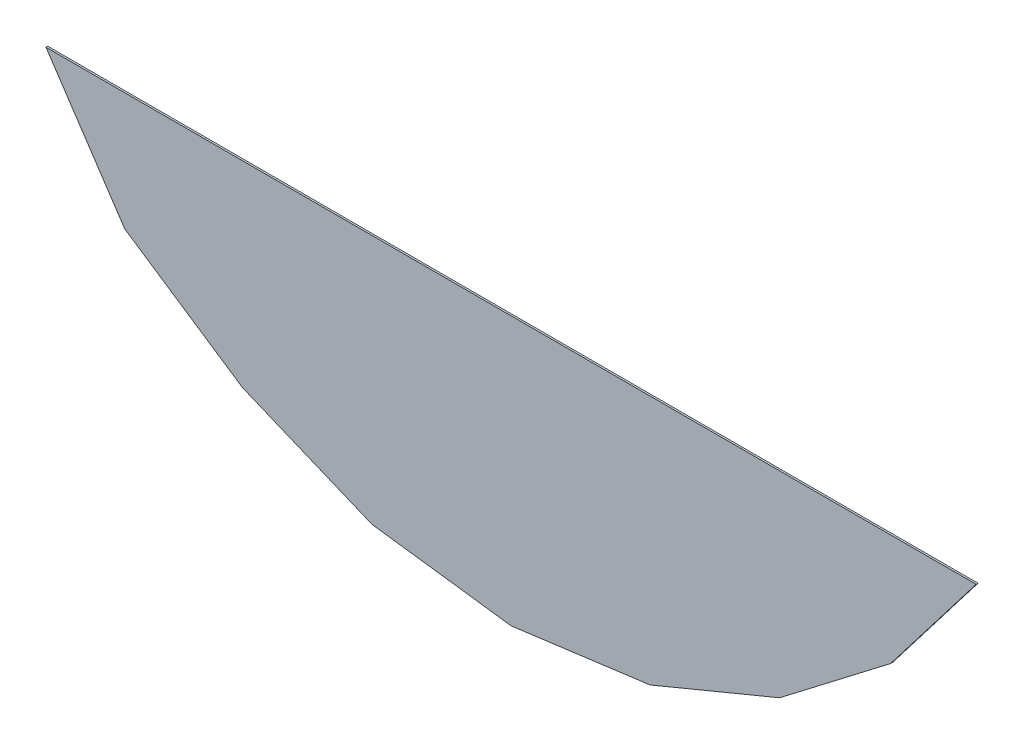
ISO-10303-21;
HEADER;
FILE_DESCRIPTION(('STEP AP214'),'2;1');
FILE_NAME('part.step','',(''),(''),'','','');
FILE_SCHEMA(('AUTOMOTIVE_DESIGN { 1 0 10303 214 1 1 1 1 }'));
ENDSEC;
DATA;
#1=APPLICATION_CONTEXT('core data for automotive mechanical design processes');
#2=APPLICATION_PROTOCOL_DEFINITION('international standard','automotive_design',2000,#1);
#3=PRODUCT_CONTEXT('',#1,'mechanical');
#4=PRODUCT('Part','Part','',(#3));
#5=PRODUCT_RELATED_PRODUCT_CATEGORY('part','',(#4));
#6=PRODUCT_DEFINITION_FORMATION('','',#4);
#7=PRODUCT_DEFINITION_CONTEXT('part definition',#1,'design');
#8=PRODUCT_DEFINITION('design','',#6,#7);
#9=PRODUCT_DEFINITION_SHAPE('','',#8);
#10=(LENGTH_UNIT() NAMED_UNIT(*) SI_UNIT(.MILLI.,.METRE.));
#11=(NAMED_UNIT(*) PLANE_ANGLE_UNIT() SI_UNIT($,.RADIAN.));
#12=(NAMED_UNIT(*) SI_UNIT($,.STERADIAN.) SOLID_ANGLE_UNIT());
#13=UNCERTAINTY_MEASURE_WITH_UNIT(LENGTH_MEASURE(1.E-05),#10,'distance_accuracy_value','');
#14=(GEOMETRIC_REPRESENTATION_CONTEXT(3) GLOBAL_UNCERTAINTY_ASSIGNED_CONTEXT((#13)) GLOBAL_UNIT_ASSIGNED_CONTEXT((#10,
#11,#12)) REPRESENTATION_CONTEXT('',''));
#15=CARTESIAN_POINT('',(0.,0.,0.));
#16=DIRECTION('',(0.,0.,1.));
#17=DIRECTION('',(1.,0.,0.));
#18=AXIS2_PLACEMENT_3D('',#15,#16,#17);
#19=CARTESIAN_POINT('',(-2.55477772,-4.28920148,3.9099998));
#20=DIRECTION('',(0.,0.,1.));
#21=DIRECTION('',(1.,0.,0.));
#22=AXIS2_PLACEMENT_3D('',#19,#20,#21);
#23=PLANE('',#22);
#24=DIRECTION('',(0.923879753352675,0.382682899206379,0.));
#25=VECTOR('',#24,1.);
#26=CARTESIAN_POINT('',(0.76351384,-5.66368184,3.9099998));
#27=LINE('',#26,#25);
#28=CARTESIAN_POINT('',(0.763513839999965,-5.66368183999992,3.9099998));
#29=VERTEX_POINT('',#28);
#30=CARTESIAN_POINT('',(1.47499832000001,-5.36897580000001,3.9099998));
#31=VERTEX_POINT('',#30);
#32=EDGE_CURVE('E91',#29,#31,#27,.T.);
#33=ORIENTED_EDGE('',*,*,#32,.T.);
#34=DIRECTION('',(0.79335418726781,0.608760325205768,0.));
#35=VECTOR('',#34,1.);
#36=CARTESIAN_POINT('',(1.47499832,-5.3689758,3.9099998));
#37=LINE('',#36,#35);
#38=CARTESIAN_POINT('',(2.08596230000002,-4.90016800000001,3.9099998));
#39=VERTEX_POINT('',#38);
#40=EDGE_CURVE('E88',#31,#39,#37,.T.);
#41=ORIENTED_EDGE('',*,*,#40,.T.);
#42=DIRECTION('',(0.608760808228414,0.793353816632332,0.));
#43=VECTOR('',#42,1.);
#44=CARTESIAN_POINT('',(2.0859623,-4.900168,3.9099998));
#45=LINE('',#44,#43);
#46=CARTESIAN_POINT('',(2.55477264,-4.28920148,3.9099998));
#47=VERTEX_POINT('',#46);
#48=EDGE_CURVE('E20',#39,#47,#45,.T.);
#49=ORIENTED_EDGE('',*,*,#48,.T.);
#50=DIRECTION('',(1.,0.,0.));
#51=VECTOR('',#50,1.);
#52=CARTESIAN_POINT('',(-2.55477772,-4.28920148,3.9099998));
#53=LINE('',#52,#51);
#54=CARTESIAN_POINT('',(-2.55477772000004,-4.28920148000002,3.9099998));
#55=VERTEX_POINT('',#54);
#56=EDGE_CURVE('E94',#55,#47,#53,.T.);
#57=ORIENTED_EDGE('',*,*,#56,.F.);
#58=DIRECTION('',(0.555139797690014,-0.831757058894417,0.));
#59=VECTOR('',#58,1.);
#60=CARTESIAN_POINT('',(-2.55477772,-4.28920148,3.9099998));
#61=LINE('',#60,#59);
#62=CARTESIAN_POINT('',(-2.12257131999998,-4.93676939999997,3.9099998));
#63=VERTEX_POINT('',#62);
#64=EDGE_CURVE('E84',#55,#63,#61,.T.);
#65=ORIENTED_EDGE('',*,*,#64,.T.);
#66=DIRECTION('',(0.831757058894417,-0.555139797690014,0.));
#67=VECTOR('',#66,1.);
#68=CARTESIAN_POINT('',(-2.12257132,-4.9367694,3.9099998));
#69=LINE('',#68,#67);
#70=CARTESIAN_POINT('',(-1.47500340000004,-5.36897580000008,3.9099998));
#71=VERTEX_POINT('',#70);
#72=EDGE_CURVE('E105',#63,#71,#69,.T.);
#73=ORIENTED_EDGE('',*,*,#72,.T.);
#74=DIRECTION('',(0.923879753352675,-0.382682899206379,0.));
#75=VECTOR('',#74,1.);
#76=CARTESIAN_POINT('',(-1.4750034,-5.3689758,3.9099998));
#77=LINE('',#76,#75);
#78=CARTESIAN_POINT('',(-0.763518920000013,-5.66368184000008,3.9099998));
#79=VERTEX_POINT('',#78);
#80=EDGE_CURVE('E106',#71,#79,#77,.T.);
#81=ORIENTED_EDGE('',*,*,#80,.T.);
#82=DIRECTION('',(0.991445008976764,-0.130525071059416,0.));
#83=VECTOR('',#82,1.);
#84=CARTESIAN_POINT('',(-0.76351892,-5.66368184,3.9099998));
#85=LINE('',#84,#83);
#86=CARTESIAN_POINT('',(-2.5400000201614E-06,-5.76419979999992,3.9099998));
#87=VERTEX_POINT('',#86);
#88=EDGE_CURVE('E110',#79,#87,#85,.T.);
#89=ORIENTED_EDGE('',*,*,#88,.T.);
#90=DIRECTION('',(0.991445008976764,0.130525071059413,0.));
#91=VECTOR('',#90,1.);
#92=CARTESIAN_POINT('',(-2.54000000806526E-06,-5.7641998,3.9099998));
#93=LINE('',#92,#91);
#94=EDGE_CURVE('E112',#87,#29,#93,.T.);
#95=ORIENTED_EDGE('',*,*,#94,.T.);
#96=EDGE_LOOP('',(#33,#41,#49,#57,#65,#73,#81,#89,#95));
#97=FACE_BOUND('',#96,.T.);
#98=ADVANCED_FACE('F17',(#97),#23,.T.);
#99=CARTESIAN_POINT('',(-2.55477772,-4.28920148,3.89999982));
#100=DIRECTION('',(0.,1.,0.));
#101=DIRECTION('',(0.,0.,1.));
#102=AXIS2_PLACEMENT_3D('',#99,#100,#101);
#103=PLANE('',#102);
#104=DIRECTION('',(0.,0.,1.));
#105=VECTOR('',#104,1.);
#106=CARTESIAN_POINT('',(-2.55477772000014,-4.2892014800001,3.89999982));
#107=LINE('',#106,#105);
#108=CARTESIAN_POINT('',(-2.55477772000004,-4.28920148000002,3.89999982));
#109=VERTEX_POINT('',#108);
#110=EDGE_CURVE('E116',#55,#109,#107,.F.);
#111=ORIENTED_EDGE('',*,*,#110,.F.);
#112=ORIENTED_EDGE('',*,*,#56,.T.);
#113=DIRECTION('',(0.,0.,1.));
#114=VECTOR('',#113,1.);
#115=CARTESIAN_POINT('',(2.55477264,-4.28920148,3.89999982));
#116=LINE('',#115,#114);
#117=CARTESIAN_POINT('',(2.55477264,-4.28920148,3.89999982));
#118=VERTEX_POINT('',#117);
#119=EDGE_CURVE('E99',#118,#47,#116,.T.);
#120=ORIENTED_EDGE('',*,*,#119,.F.);
#121=DIRECTION('',(1.,0.,0.));
#122=VECTOR('',#121,1.);
#123=CARTESIAN_POINT('',(-2.55477772,-4.28920148,3.89999982));
#124=LINE('',#123,#122);
#125=EDGE_CURVE('E130',#118,#109,#124,.F.);
#126=ORIENTED_EDGE('',*,*,#125,.T.);
#127=EDGE_LOOP('',(#111,#112,#120,#126));
#128=FACE_BOUND('',#127,.T.);
#129=ADVANCED_FACE('F181',(#128),#103,.T.);
#130=CARTESIAN_POINT('',(-2.12257132,-4.9367694,3.89999982));
#131=DIRECTION('',(-0.831757058894295,-0.555139797690197,0.));
#132=DIRECTION('',(0.555139797690197,-0.831757058894295,0.));
#133=AXIS2_PLACEMENT_3D('',#130,#131,#132);
#134=PLANE('',#133);
#135=DIRECTION('',(0.,0.,1.));
#136=VECTOR('',#135,1.);
#137=CARTESIAN_POINT('',(-2.12257131999991,-4.93676939999986,3.89999982));
#138=LINE('',#137,#136);
#139=CARTESIAN_POINT('',(-2.12257131999998,-4.93676939999997,3.89999982));
#140=VERTEX_POINT('',#139);
#141=EDGE_CURVE('E118',#63,#140,#138,.F.);
#142=ORIENTED_EDGE('',*,*,#141,.F.);
#143=ORIENTED_EDGE('',*,*,#64,.F.);
#144=ORIENTED_EDGE('',*,*,#110,.T.);
#145=DIRECTION('',(0.555139797690014,-0.831757058894417,0.));
#146=VECTOR('',#145,1.);
#147=CARTESIAN_POINT('',(-2.55477772,-4.28920148,3.89999982));
#148=LINE('',#147,#146);
#149=EDGE_CURVE('E133',#109,#140,#148,.T.);
#150=ORIENTED_EDGE('',*,*,#149,.T.);
#151=EDGE_LOOP('',(#142,#143,#144,#150));
#152=FACE_BOUND('',#151,.T.);
#153=ADVANCED_FACE('F178',(#152),#134,.T.);
#154=CARTESIAN_POINT('',(-1.4750034,-5.3689758,3.89999982));
#155=DIRECTION('',(-0.555139797690197,-0.831757058894295,0.));
#156=DIRECTION('',(0.831757058894295,-0.555139797690197,0.));
#157=AXIS2_PLACEMENT_3D('',#154,#155,#156);
#158=PLANE('',#157);
#159=DIRECTION('',(0.,0.,1.));
#160=VECTOR('',#159,1.);
#161=CARTESIAN_POINT('',(-1.47500340000014,-5.36897580000034,3.89999982));
#162=LINE('',#161,#160);
#163=CARTESIAN_POINT('',(-1.47500340000004,-5.36897580000008,3.89999982));
#164=VERTEX_POINT('',#163);
#165=EDGE_CURVE('E120',#71,#164,#162,.F.);
#166=ORIENTED_EDGE('',*,*,#165,.F.);
#167=ORIENTED_EDGE('',*,*,#72,.F.);
#168=ORIENTED_EDGE('',*,*,#141,.T.);
#169=DIRECTION('',(0.831757058894417,-0.555139797690014,0.));
#170=VECTOR('',#169,1.);
#171=CARTESIAN_POINT('',(-2.12257132,-4.9367694,3.89999982));
#172=LINE('',#171,#170);
#173=EDGE_CURVE('E136',#140,#164,#172,.T.);
#174=ORIENTED_EDGE('',*,*,#173,.T.);
#175=EDGE_LOOP('',(#166,#167,#168,#174));
#176=FACE_BOUND('',#175,.T.);
#177=ADVANCED_FACE('F175',(#176),#158,.T.);
#178=CARTESIAN_POINT('',(-0.76351892,-5.66368184,3.89999982));
#179=DIRECTION('',(-0.382682899205941,-0.923879753352857,0.));
#180=DIRECTION('',(0.923879753352857,-0.382682899205941,0.));
#181=AXIS2_PLACEMENT_3D('',#178,#179,#180);
#182=PLANE('',#181);
#183=DIRECTION('',(0.,0.,1.));
#184=VECTOR('',#183,1.);
#185=CARTESIAN_POINT('',(-0.763518920000045,-5.66368184000034,3.89999982));
#186=LINE('',#185,#184);
#187=CARTESIAN_POINT('',(-0.763518920000012,-5.66368184000008,3.89999982));
#188=VERTEX_POINT('',#187);
#189=EDGE_CURVE('E122',#79,#188,#186,.F.);
#190=ORIENTED_EDGE('',*,*,#189,.F.);
#191=ORIENTED_EDGE('',*,*,#80,.F.);
#192=ORIENTED_EDGE('',*,*,#165,.T.);
#193=DIRECTION('',(0.923879753352675,-0.382682899206379,0.));
#194=VECTOR('',#193,1.);
#195=CARTESIAN_POINT('',(-1.4750034,-5.3689758,3.89999982));
#196=LINE('',#195,#194);
#197=EDGE_CURVE('E139',#164,#188,#196,.T.);
#198=ORIENTED_EDGE('',*,*,#197,.T.);
#199=EDGE_LOOP('',(#190,#191,#192,#198));
#200=FACE_BOUND('',#199,.T.);
#201=ADVANCED_FACE('F170',(#200),#182,.T.);
#202=CARTESIAN_POINT('',(-2.539999996998E-06,-5.7641998,3.89999982));
#203=DIRECTION('',(-0.130525071058976,-0.991445008976821,0.));
#204=DIRECTION('',(0.991445008976821,-0.130525071058976,0.));
#205=AXIS2_PLACEMENT_3D('',#202,#203,#204);
#206=PLANE('',#205);
#207=DIRECTION('',(0.,0.,1.));
#208=VECTOR('',#207,1.);
#209=CARTESIAN_POINT('',(-2.54000005240913E-06,-5.76419979999966,3.89999982));
#210=LINE('',#209,#208);
#211=CARTESIAN_POINT('',(-2.54000001963974E-06,-5.76419979999992,3.89999982));
#212=VERTEX_POINT('',#211);
#213=EDGE_CURVE('E124',#87,#212,#210,.F.);
#214=ORIENTED_EDGE('',*,*,#213,.F.);
#215=ORIENTED_EDGE('',*,*,#88,.F.);
#216=ORIENTED_EDGE('',*,*,#189,.T.);
#217=DIRECTION('',(0.991445008976764,-0.130525071059416,0.));
#218=VECTOR('',#217,1.);
#219=CARTESIAN_POINT('',(-0.76351892,-5.66368184,3.89999982));
#220=LINE('',#219,#218);
#221=EDGE_CURVE('E142',#188,#212,#220,.T.);
#222=ORIENTED_EDGE('',*,*,#221,.T.);
#223=EDGE_LOOP('',(#214,#215,#216,#222));
#224=FACE_BOUND('',#223,.T.);
#225=ADVANCED_FACE('F165',(#224),#206,.T.);
#226=CARTESIAN_POINT('',(0.76351384,-5.66368184,3.89999982));
#227=DIRECTION('',(0.130525071058976,-0.991445008976821,0.));
#228=DIRECTION('',(0.991445008976821,0.130525071058976,0.));
#229=AXIS2_PLACEMENT_3D('',#226,#227,#228);
#230=PLANE('',#229);
#231=DIRECTION('',(0.,0.,1.));
#232=VECTOR('',#231,1.);
#233=CARTESIAN_POINT('',(0.76351383999986,-5.66368183999966,3.89999982));
#234=LINE('',#233,#232);
#235=CARTESIAN_POINT('',(0.763513839999965,-5.66368183999992,3.89999982));
#236=VERTEX_POINT('',#235);
#237=EDGE_CURVE('E126',#29,#236,#234,.F.);
#238=ORIENTED_EDGE('',*,*,#237,.F.);
#239=ORIENTED_EDGE('',*,*,#94,.F.);
#240=ORIENTED_EDGE('',*,*,#213,.T.);
#241=DIRECTION('',(0.991445008976764,0.130525071059413,0.));
#242=VECTOR('',#241,1.);
#243=CARTESIAN_POINT('',(-2.54000000806526E-06,-5.7641998,3.89999982));
#244=LINE('',#243,#242);
#245=EDGE_CURVE('E145',#212,#236,#244,.T.);
#246=ORIENTED_EDGE('',*,*,#245,.T.);
#247=EDGE_LOOP('',(#238,#239,#240,#246));
#248=FACE_BOUND('',#247,.T.);
#249=ADVANCED_FACE('F160',(#248),#230,.T.);
#250=CARTESIAN_POINT('',(1.47499832,-5.3689758,3.89999982));
#251=DIRECTION('',(0.382682899205941,-0.923879753352857,0.));
#252=DIRECTION('',(0.923879753352857,0.382682899205941,0.));
#253=AXIS2_PLACEMENT_3D('',#250,#251,#252);
#254=PLANE('',#253);
#255=DIRECTION('',(0.,0.,1.));
#256=VECTOR('',#255,1.);
#257=CARTESIAN_POINT('',(1.47499832000003,-5.36897580000004,3.89999982));
#258=LINE('',#257,#256);
#259=CARTESIAN_POINT('',(1.47499832000001,-5.36897580000001,3.89999982));
#260=VERTEX_POINT('',#259);
#261=EDGE_CURVE('E100',#31,#260,#258,.F.);
#262=ORIENTED_EDGE('',*,*,#261,.F.);
#263=ORIENTED_EDGE('',*,*,#32,.F.);
#264=ORIENTED_EDGE('',*,*,#237,.T.);
#265=DIRECTION('',(0.923879753352675,0.382682899206379,0.));
#266=VECTOR('',#265,1.);
#267=CARTESIAN_POINT('',(0.76351384,-5.66368184,3.89999982));
#268=LINE('',#267,#266);
#269=EDGE_CURVE('E148',#236,#260,#268,.T.);
#270=ORIENTED_EDGE('',*,*,#269,.T.);
#271=EDGE_LOOP('',(#262,#263,#264,#270));
#272=FACE_BOUND('',#271,.T.);
#273=ADVANCED_FACE('F153',(#272),#254,.T.);
#274=CARTESIAN_POINT('',(2.0859623,-4.900168,3.89999982));
#275=DIRECTION('',(0.608760325205822,-0.793354187267769,0.));
#276=DIRECTION('',(0.793354187267769,0.608760325205822,0.));
#277=AXIS2_PLACEMENT_3D('',#274,#275,#276);
#278=PLANE('',#277);
#279=DIRECTION('',(0.,0.,1.));
#280=VECTOR('',#279,1.);
#281=CARTESIAN_POINT('',(2.08596230000008,-4.90016800000006,3.89999982));
#282=LINE('',#281,#280);
#283=CARTESIAN_POINT('',(2.08596230000002,-4.90016800000001,3.89999982));
#284=VERTEX_POINT('',#283);
#285=EDGE_CURVE('E34',#39,#284,#282,.F.);
#286=ORIENTED_EDGE('',*,*,#285,.F.);
#287=ORIENTED_EDGE('',*,*,#40,.F.);
#288=ORIENTED_EDGE('',*,*,#261,.T.);
#289=DIRECTION('',(0.79335418726781,0.608760325205768,0.));
#290=VECTOR('',#289,1.);
#291=CARTESIAN_POINT('',(1.47499832,-5.3689758,3.89999982));
#292=LINE('',#291,#290);
#293=EDGE_CURVE('E26',#260,#284,#292,.T.);
#294=ORIENTED_EDGE('',*,*,#293,.T.);
#295=EDGE_LOOP('',(#286,#287,#288,#294));
#296=FACE_BOUND('',#295,.T.);
#297=ADVANCED_FACE('F97',(#296),#278,.T.);
#298=CARTESIAN_POINT('',(2.55477264,-4.28920148,3.89999982));
#299=DIRECTION('',(0.793353816632409,-0.608760808228314,0.));
#300=DIRECTION('',(0.608760808228314,0.793353816632409,0.));
#301=AXIS2_PLACEMENT_3D('',#298,#299,#300);
#302=PLANE('',#301);
#303=ORIENTED_EDGE('',*,*,#119,.T.);
#304=ORIENTED_EDGE('',*,*,#48,.F.);
#305=ORIENTED_EDGE('',*,*,#285,.T.);
#306=DIRECTION('',(0.608760808228414,0.793353816632332,0.));
#307=VECTOR('',#306,1.);
#308=CARTESIAN_POINT('',(2.0859623,-4.900168,3.89999982));
#309=LINE('',#308,#307);
#310=EDGE_CURVE('E11',#284,#118,#309,.T.);
#311=ORIENTED_EDGE('',*,*,#310,.T.);
#312=EDGE_LOOP('',(#303,#304,#305,#311));
#313=FACE_BOUND('',#312,.T.);
#314=ADVANCED_FACE('F103',(#313),#302,.T.);
#315=CARTESIAN_POINT('',(-2.55477772,-4.28920148,3.89999982));
#316=DIRECTION('',(0.,0.,1.));
#317=DIRECTION('',(1.,0.,0.));
#318=AXIS2_PLACEMENT_3D('',#315,#316,#317);
#319=PLANE('',#318);
#320=ORIENTED_EDGE('',*,*,#293,.F.);
#321=ORIENTED_EDGE('',*,*,#269,.F.);
#322=ORIENTED_EDGE('',*,*,#245,.F.);
#323=ORIENTED_EDGE('',*,*,#221,.F.);
#324=ORIENTED_EDGE('',*,*,#197,.F.);
#325=ORIENTED_EDGE('',*,*,#173,.F.);
#326=ORIENTED_EDGE('',*,*,#149,.F.);
#327=ORIENTED_EDGE('',*,*,#125,.F.);
#328=ORIENTED_EDGE('',*,*,#310,.F.);
#329=EDGE_LOOP('',(#320,#321,#322,#323,#324,#325,#326,#327,#328));
#330=FACE_BOUND('',#329,.T.);
#331=ADVANCED_FACE('F157',(#330),#319,.F.);
#332=CLOSED_SHELL('',(#98,#129,#153,#177,#201,#225,#249,#273,#297,#314,#331));
#333=MANIFOLD_SOLID_BREP('B1',#332);
#334=ADVANCED_BREP_SHAPE_REPRESENTATION('',(#18,#333),#14);
#335=SHAPE_DEFINITION_REPRESENTATION(#9,#334);
ENDSEC;
END-ISO-10303-21;
